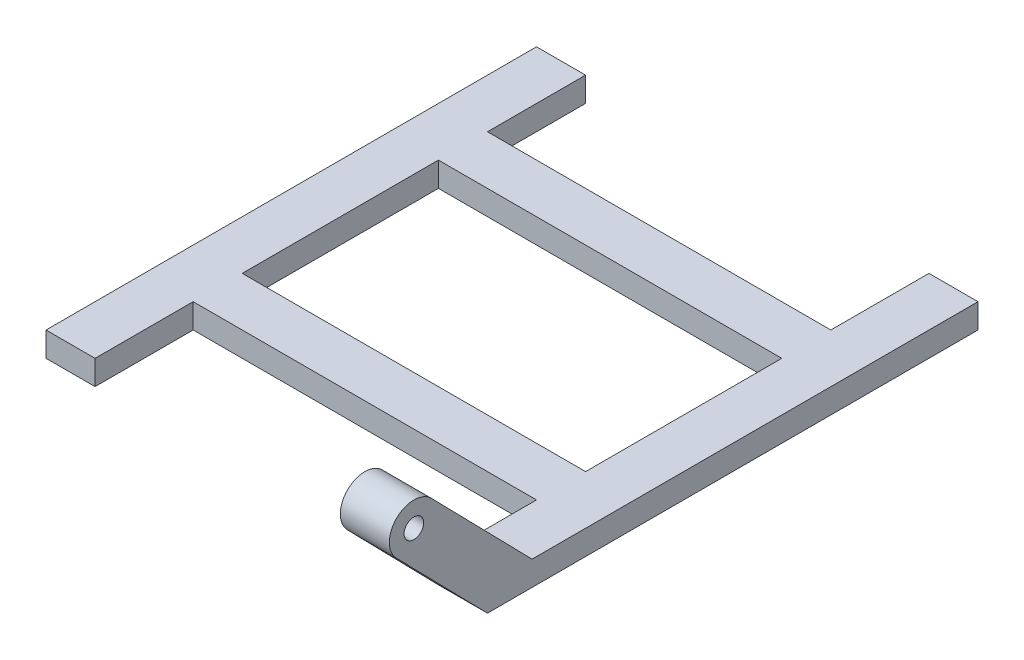
ISO-10303-21;
HEADER;
FILE_DESCRIPTION(('STEP AP214'),'2;1');
FILE_NAME('part.step','',(''),(''),'','','');
FILE_SCHEMA(('AUTOMOTIVE_DESIGN { 1 0 10303 214 1 1 1 1 }'));
ENDSEC;
DATA;
#1=APPLICATION_CONTEXT('core data for automotive mechanical design processes');
#2=APPLICATION_PROTOCOL_DEFINITION('international standard','automotive_design',2000,#1);
#3=PRODUCT_CONTEXT('',#1,'mechanical');
#4=PRODUCT('Part','Part','',(#3));
#5=PRODUCT_RELATED_PRODUCT_CATEGORY('part','',(#4));
#6=PRODUCT_DEFINITION_FORMATION('','',#4);
#7=PRODUCT_DEFINITION_CONTEXT('part definition',#1,'design');
#8=PRODUCT_DEFINITION('design','',#6,#7);
#9=PRODUCT_DEFINITION_SHAPE('','',#8);
#10=(LENGTH_UNIT() NAMED_UNIT(*) SI_UNIT(.MILLI.,.METRE.));
#11=(NAMED_UNIT(*) PLANE_ANGLE_UNIT() SI_UNIT($,.RADIAN.));
#12=(NAMED_UNIT(*) SI_UNIT($,.STERADIAN.) SOLID_ANGLE_UNIT());
#13=UNCERTAINTY_MEASURE_WITH_UNIT(LENGTH_MEASURE(1.E-05),#10,'distance_accuracy_value','');
#14=(GEOMETRIC_REPRESENTATION_CONTEXT(3) GLOBAL_UNCERTAINTY_ASSIGNED_CONTEXT((#13)) GLOBAL_UNIT_ASSIGNED_CONTEXT((#10,
#11,#12)) REPRESENTATION_CONTEXT('',''));
#15=CARTESIAN_POINT('',(0.,0.,0.));
#16=DIRECTION('',(0.,0.,1.));
#17=DIRECTION('',(1.,0.,0.));
#18=AXIS2_PLACEMENT_3D('',#15,#16,#17);
#19=CARTESIAN_POINT('',(0.,5.,-25.));
#20=DIRECTION('',(0.,0.,-1.));
#21=DIRECTION('',(-1.,0.,0.));
#22=AXIS2_PLACEMENT_3D('',#19,#20,#21);
#23=PLANE('',#22);
#24=DIRECTION('',(1.,0.,0.));
#25=VECTOR('',#24,1.);
#26=CARTESIAN_POINT('',(0.,0.,-25.));
#27=LINE('',#26,#25);
#28=CARTESIAN_POINT('',(-45.,0.,-25.));
#29=VERTEX_POINT('',#28);
#30=CARTESIAN_POINT('',(-35.,0.,-25.));
#31=VERTEX_POINT('',#30);
#32=EDGE_CURVE('E286',#29,#31,#27,.T.);
#33=ORIENTED_EDGE('',*,*,#32,.F.);
#34=DIRECTION('',(0.,-1.,0.));
#35=VECTOR('',#34,1.);
#36=CARTESIAN_POINT('',(-45.,5.,-25.));
#37=LINE('',#36,#35);
#38=CARTESIAN_POINT('',(-45.,5.,-25.));
#39=VERTEX_POINT('',#38);
#40=EDGE_CURVE('E332',#39,#29,#37,.T.);
#41=ORIENTED_EDGE('',*,*,#40,.F.);
#42=DIRECTION('',(1.,0.,0.));
#43=VECTOR('',#42,1.);
#44=CARTESIAN_POINT('',(0.,5.,-25.));
#45=LINE('',#44,#43);
#46=CARTESIAN_POINT('',(-35.,5.,-25.));
#47=VERTEX_POINT('',#46);
#48=EDGE_CURVE('E258',#39,#47,#45,.T.);
#49=ORIENTED_EDGE('',*,*,#48,.T.);
#50=DIRECTION('',(0.,-1.,0.));
#51=VECTOR('',#50,1.);
#52=CARTESIAN_POINT('',(-35.,5.,-25.));
#53=LINE('',#52,#51);
#54=EDGE_CURVE('E334',#47,#31,#53,.T.);
#55=ORIENTED_EDGE('',*,*,#54,.T.);
#56=EDGE_LOOP('',(#33,#41,#49,#55));
#57=FACE_BOUND('',#56,.T.);
#58=ADVANCED_FACE('F89',(#57),#23,.T.);
#59=CARTESIAN_POINT('',(-45.,5.,0.));
#60=DIRECTION('',(1.,0.,0.));
#61=DIRECTION('',(0.,0.,-1.));
#62=AXIS2_PLACEMENT_3D('',#59,#60,#61);
#63=PLANE('',#62);
#64=DIRECTION('',(0.,0.,1.));
#65=VECTOR('',#64,1.);
#66=CARTESIAN_POINT('',(-45.,0.,0.));
#67=LINE('',#66,#65);
#68=CARTESIAN_POINT('',(-45.,0.,75.));
#69=VERTEX_POINT('',#68);
#70=EDGE_CURVE('E292',#29,#69,#67,.T.);
#71=ORIENTED_EDGE('',*,*,#70,.T.);
#72=DIRECTION('',(0.,-1.,0.));
#73=VECTOR('',#72,1.);
#74=CARTESIAN_POINT('',(-45.,5.,75.));
#75=LINE('',#74,#73);
#76=CARTESIAN_POINT('',(-45.,5.,75.));
#77=VERTEX_POINT('',#76);
#78=EDGE_CURVE('E329',#77,#69,#75,.T.);
#79=ORIENTED_EDGE('',*,*,#78,.F.);
#80=DIRECTION('',(0.,0.,1.));
#81=VECTOR('',#80,1.);
#82=CARTESIAN_POINT('',(-45.,5.,0.));
#83=LINE('',#82,#81);
#84=EDGE_CURVE('E264',#39,#77,#83,.T.);
#85=ORIENTED_EDGE('',*,*,#84,.F.);
#86=ORIENTED_EDGE('',*,*,#40,.T.);
#87=EDGE_LOOP('',(#71,#79,#85,#86));
#88=FACE_BOUND('',#87,.T.);
#89=ADVANCED_FACE('F427',(#88),#63,.F.);
#90=CARTESIAN_POINT('',(0.,5.,75.));
#91=DIRECTION('',(0.,0.,-1.));
#92=DIRECTION('',(-1.,0.,0.));
#93=AXIS2_PLACEMENT_3D('',#90,#91,#92);
#94=PLANE('',#93);
#95=DIRECTION('',(1.,0.,0.));
#96=VECTOR('',#95,1.);
#97=CARTESIAN_POINT('',(0.,0.,75.));
#98=LINE('',#97,#96);
#99=CARTESIAN_POINT('',(-35.,0.,75.));
#100=VERTEX_POINT('',#99);
#101=EDGE_CURVE('E294',#69,#100,#98,.T.);
#102=ORIENTED_EDGE('',*,*,#101,.T.);
#103=DIRECTION('',(0.,-1.,0.));
#104=VECTOR('',#103,1.);
#105=CARTESIAN_POINT('',(-35.,5.,75.));
#106=LINE('',#105,#104);
#107=CARTESIAN_POINT('',(-35.,5.,75.));
#108=VERTEX_POINT('',#107);
#109=EDGE_CURVE('E326',#108,#100,#106,.T.);
#110=ORIENTED_EDGE('',*,*,#109,.F.);
#111=DIRECTION('',(1.,0.,0.));
#112=VECTOR('',#111,1.);
#113=CARTESIAN_POINT('',(0.,5.,75.));
#114=LINE('',#113,#112);
#115=EDGE_CURVE('E266',#77,#108,#114,.T.);
#116=ORIENTED_EDGE('',*,*,#115,.F.);
#117=ORIENTED_EDGE('',*,*,#78,.T.);
#118=EDGE_LOOP('',(#102,#110,#116,#117));
#119=FACE_BOUND('',#118,.T.);
#120=ADVANCED_FACE('F423',(#119),#94,.F.);
#121=CARTESIAN_POINT('',(-35.,5.,0.));
#122=DIRECTION('',(1.,0.,0.));
#123=DIRECTION('',(0.,0.,-1.));
#124=AXIS2_PLACEMENT_3D('',#121,#122,#123);
#125=PLANE('',#124);
#126=DIRECTION('',(0.,0.,1.));
#127=VECTOR('',#126,1.);
#128=CARTESIAN_POINT('',(-35.,0.,0.));
#129=LINE('',#128,#127);
#130=CARTESIAN_POINT('',(-35.,0.,55.));
#131=VERTEX_POINT('',#130);
#132=EDGE_CURVE('E288',#131,#100,#129,.T.);
#133=ORIENTED_EDGE('',*,*,#132,.F.);
#134=DIRECTION('',(0.,1.,0.));
#135=VECTOR('',#134,1.);
#136=CARTESIAN_POINT('',(-35.,5.,55.));
#137=LINE('',#136,#135);
#138=CARTESIAN_POINT('',(-35.,5.,55.));
#139=VERTEX_POINT('',#138);
#140=EDGE_CURVE('E98',#131,#139,#137,.T.);
#141=ORIENTED_EDGE('',*,*,#140,.T.);
#142=DIRECTION('',(0.,0.,1.));
#143=VECTOR('',#142,1.);
#144=CARTESIAN_POINT('',(-35.,5.,0.));
#145=LINE('',#144,#143);
#146=EDGE_CURVE('E260',#139,#108,#145,.T.);
#147=ORIENTED_EDGE('',*,*,#146,.T.);
#148=ORIENTED_EDGE('',*,*,#109,.T.);
#149=EDGE_LOOP('',(#133,#141,#147,#148));
#150=FACE_BOUND('',#149,.T.);
#151=ADVANCED_FACE('F419',(#150),#125,.T.);
#152=DIRECTION('',(0.,1.,0.));
#153=VECTOR('',#152,1.);
#154=CARTESIAN_POINT('',(-35.,5.,45.));
#155=LINE('',#154,#153);
#156=CARTESIAN_POINT('',(-35.,0.,45.));
#157=VERTEX_POINT('',#156);
#158=CARTESIAN_POINT('',(-35.,5.,45.));
#159=VERTEX_POINT('',#158);
#160=EDGE_CURVE('E12',#157,#159,#155,.T.);
#161=ORIENTED_EDGE('',*,*,#160,.F.);
#162=CARTESIAN_POINT('',(-35.,0.,5.));
#163=VERTEX_POINT('',#162);
#164=EDGE_CURVE('E289',#163,#157,#129,.T.);
#165=ORIENTED_EDGE('',*,*,#164,.F.);
#166=DIRECTION('',(0.,-1.,0.));
#167=VECTOR('',#166,1.);
#168=CARTESIAN_POINT('',(-35.,5.,5.));
#169=LINE('',#168,#167);
#170=CARTESIAN_POINT('',(-35.,5.,5.));
#171=VERTEX_POINT('',#170);
#172=EDGE_CURVE('E324',#171,#163,#169,.T.);
#173=ORIENTED_EDGE('',*,*,#172,.F.);
#174=EDGE_CURVE('E261',#171,#159,#145,.T.);
#175=ORIENTED_EDGE('',*,*,#174,.T.);
#176=EDGE_LOOP('',(#161,#165,#173,#175));
#177=FACE_BOUND('',#176,.T.);
#178=ADVANCED_FACE('F434',(#177),#125,.T.);
#179=CARTESIAN_POINT('',(0.,5.,5.));
#180=DIRECTION('',(0.,0.,-1.));
#181=DIRECTION('',(-1.,0.,0.));
#182=AXIS2_PLACEMENT_3D('',#179,#180,#181);
#183=PLANE('',#182);
#184=DIRECTION('',(1.,0.,0.));
#185=VECTOR('',#184,1.);
#186=CARTESIAN_POINT('',(0.,0.,5.));
#187=LINE('',#186,#185);
#188=CARTESIAN_POINT('',(35.,0.,5.));
#189=VERTEX_POINT('',#188);
#190=EDGE_CURVE('E297',#163,#189,#187,.T.);
#191=ORIENTED_EDGE('',*,*,#190,.T.);
#192=DIRECTION('',(0.,-1.,0.));
#193=VECTOR('',#192,1.);
#194=CARTESIAN_POINT('',(35.,5.,5.));
#195=LINE('',#194,#193);
#196=CARTESIAN_POINT('',(35.,5.,5.));
#197=VERTEX_POINT('',#196);
#198=EDGE_CURVE('E321',#197,#189,#195,.T.);
#199=ORIENTED_EDGE('',*,*,#198,.F.);
#200=DIRECTION('',(1.,0.,0.));
#201=VECTOR('',#200,1.);
#202=CARTESIAN_POINT('',(0.,5.,5.));
#203=LINE('',#202,#201);
#204=EDGE_CURVE('E269',#171,#197,#203,.T.);
#205=ORIENTED_EDGE('',*,*,#204,.F.);
#206=ORIENTED_EDGE('',*,*,#172,.T.);
#207=EDGE_LOOP('',(#191,#199,#205,#206));
#208=FACE_BOUND('',#207,.T.);
#209=ADVANCED_FACE('F442',(#208),#183,.F.);
#210=CARTESIAN_POINT('',(35.,5.,0.));
#211=DIRECTION('',(1.,0.,0.));
#212=DIRECTION('',(0.,0.,-1.));
#213=AXIS2_PLACEMENT_3D('',#210,#211,#212);
#214=PLANE('',#213);
#215=DIRECTION('',(0.,0.,1.));
#216=VECTOR('',#215,1.);
#217=CARTESIAN_POINT('',(35.,0.,0.));
#218=LINE('',#217,#216);
#219=CARTESIAN_POINT('',(35.,0.,45.));
#220=VERTEX_POINT('',#219);
#221=EDGE_CURVE('E300',#189,#220,#218,.T.);
#222=ORIENTED_EDGE('',*,*,#221,.T.);
#223=DIRECTION('',(0.,1.,0.));
#224=VECTOR('',#223,1.);
#225=CARTESIAN_POINT('',(35.,5.,45.));
#226=LINE('',#225,#224);
#227=CARTESIAN_POINT('',(35.,5.,45.));
#228=VERTEX_POINT('',#227);
#229=EDGE_CURVE('E338',#220,#228,#226,.T.);
#230=ORIENTED_EDGE('',*,*,#229,.T.);
#231=DIRECTION('',(0.,0.,1.));
#232=VECTOR('',#231,1.);
#233=CARTESIAN_POINT('',(35.,5.,0.));
#234=LINE('',#233,#232);
#235=EDGE_CURVE('E271',#197,#228,#234,.T.);
#236=ORIENTED_EDGE('',*,*,#235,.F.);
#237=ORIENTED_EDGE('',*,*,#198,.T.);
#238=EDGE_LOOP('',(#222,#230,#236,#237));
#239=FACE_BOUND('',#238,.T.);
#240=ADVANCED_FACE('F387',(#239),#214,.F.);
#241=CARTESIAN_POINT('',(35.,0.,55.));
#242=VERTEX_POINT('',#241);
#243=CARTESIAN_POINT('',(35.,0.,75.));
#244=VERTEX_POINT('',#243);
#245=EDGE_CURVE('E299',#242,#244,#218,.T.);
#246=ORIENTED_EDGE('',*,*,#245,.T.);
#247=DIRECTION('',(0.,-0.715139421492409,-0.698981836550495));
#248=VECTOR('',#247,1.);
#249=CARTESIAN_POINT('',(35.,-37.4902099668317,38.3568294129373));
#250=LINE('',#249,#248);
#251=CARTESIAN_POINT('',(35.,19.0050908172475,93.5756971074621));
#252=VERTEX_POINT('',#251);
#253=EDGE_CURVE('E248',#252,#244,#250,.T.);
#254=ORIENTED_EDGE('',*,*,#253,.F.);
#255=CARTESIAN_POINT('',(35.,22.5,90.));
#256=DIRECTION('',(1.,0.,0.));
#257=DIRECTION('',(0.,0.,-1.));
#258=AXIS2_PLACEMENT_3D('',#255,#256,#257);
#259=CIRCLE('',#258,5.);
#260=CARTESIAN_POINT('',(35.,25.9949091827525,86.424302892538));
#261=VERTEX_POINT('',#260);
#262=EDGE_CURVE('E254',#252,#261,#259,.F.);
#263=ORIENTED_EDGE('',*,*,#262,.T.);
#264=DIRECTION('',(0.,-0.715139421492409,-0.698981836550495));
#265=VECTOR('',#264,1.);
#266=CARTESIAN_POINT('',(35.,-30.5003916013267,31.2054351980132));
#267=LINE('',#266,#265);
#268=CARTESIAN_POINT('',(35.,5.,65.9037446101458));
#269=VERTEX_POINT('',#268);
#270=EDGE_CURVE('E222',#261,#269,#267,.T.);
#271=ORIENTED_EDGE('',*,*,#270,.T.);
#272=CARTESIAN_POINT('',(35.,5.,55.));
#273=VERTEX_POINT('',#272);
#274=EDGE_CURVE('E111',#273,#269,#234,.T.);
#275=ORIENTED_EDGE('',*,*,#274,.F.);
#276=DIRECTION('',(0.,1.,0.));
#277=VECTOR('',#276,1.);
#278=CARTESIAN_POINT('',(35.,5.,55.));
#279=LINE('',#278,#277);
#280=EDGE_CURVE('E336',#242,#273,#279,.T.);
#281=ORIENTED_EDGE('',*,*,#280,.F.);
#282=EDGE_LOOP('',(#246,#254,#263,#271,#275,#281));
#283=FACE_BOUND('',#282,.T.);
#284=CARTESIAN_POINT('',(35.,22.5,90.));
#285=DIRECTION('',(1.,0.,0.));
#286=DIRECTION('',(0.,0.,-1.));
#287=AXIS2_PLACEMENT_3D('',#284,#285,#286);
#288=CIRCLE('',#287,2.);
#289=CARTESIAN_POINT('',(35.,22.5,88.));
#290=VERTEX_POINT('',#289);
#291=EDGE_CURVE('E250',#290,#290,#288,.F.);
#292=ORIENTED_EDGE('',*,*,#291,.F.);
#293=EDGE_LOOP('',(#292));
#294=FACE_BOUND('',#293,.T.);
#295=ADVANCED_FACE('F384',(#283,#294),#214,.F.);
#296=CARTESIAN_POINT('',(45.,5.,0.));
#297=DIRECTION('',(1.,0.,0.));
#298=DIRECTION('',(0.,0.,-1.));
#299=AXIS2_PLACEMENT_3D('',#296,#297,#298);
#300=PLANE('',#299);
#301=DIRECTION('',(0.,0.715139421492409,0.698981836550495));
#302=VECTOR('',#301,1.);
#303=CARTESIAN_POINT('',(45.,-37.4902099668317,38.3568294129373));
#304=LINE('',#303,#302);
#305=CARTESIAN_POINT('',(45.,0.,75.));
#306=VERTEX_POINT('',#305);
#307=CARTESIAN_POINT('',(45.,19.0050908172475,93.575697107462));
#308=VERTEX_POINT('',#307);
#309=EDGE_CURVE('E235',#306,#308,#304,.T.);
#310=ORIENTED_EDGE('',*,*,#309,.F.);
#311=DIRECTION('',(0.,0.,1.));
#312=VECTOR('',#311,1.);
#313=CARTESIAN_POINT('',(45.,0.,0.));
#314=LINE('',#313,#312);
#315=CARTESIAN_POINT('',(45.,0.,-25.));
#316=VERTEX_POINT('',#315);
#317=EDGE_CURVE('E307',#316,#306,#314,.T.);
#318=ORIENTED_EDGE('',*,*,#317,.F.);
#319=DIRECTION('',(0.,-1.,0.));
#320=VECTOR('',#319,1.);
#321=CARTESIAN_POINT('',(45.,5.,-25.));
#322=LINE('',#321,#320);
#323=CARTESIAN_POINT('',(45.,5.,-25.));
#324=VERTEX_POINT('',#323);
#325=EDGE_CURVE('E319',#324,#316,#322,.T.);
#326=ORIENTED_EDGE('',*,*,#325,.F.);
#327=DIRECTION('',(0.,0.,1.));
#328=VECTOR('',#327,1.);
#329=CARTESIAN_POINT('',(45.,5.,0.));
#330=LINE('',#329,#328);
#331=CARTESIAN_POINT('',(45.,5.,65.9037446101458));
#332=VERTEX_POINT('',#331);
#333=EDGE_CURVE('E239',#324,#332,#330,.T.);
#334=ORIENTED_EDGE('',*,*,#333,.T.);
#335=DIRECTION('',(0.,0.715139421492409,0.698981836550495));
#336=VECTOR('',#335,1.);
#337=CARTESIAN_POINT('',(45.,-30.5003916013267,31.2054351980132));
#338=LINE('',#337,#336);
#339=CARTESIAN_POINT('',(45.,25.9949091827525,86.424302892538));
#340=VERTEX_POINT('',#339);
#341=EDGE_CURVE('E221',#332,#340,#338,.T.);
#342=ORIENTED_EDGE('',*,*,#341,.T.);
#343=CARTESIAN_POINT('',(45.,22.5,90.));
#344=DIRECTION('',(1.,0.,0.));
#345=DIRECTION('',(0.,0.,-1.));
#346=AXIS2_PLACEMENT_3D('',#343,#344,#345);
#347=CIRCLE('',#346,5.);
#348=EDGE_CURVE('E229',#340,#308,#347,.T.);
#349=ORIENTED_EDGE('',*,*,#348,.T.);
#350=EDGE_LOOP('',(#310,#318,#326,#334,#342,#349));
#351=FACE_BOUND('',#350,.T.);
#352=CARTESIAN_POINT('',(45.,22.5,90.));
#353=DIRECTION('',(1.,0.,0.));
#354=DIRECTION('',(0.,0.,-1.));
#355=AXIS2_PLACEMENT_3D('',#352,#353,#354);
#356=CIRCLE('',#355,2.);
#357=CARTESIAN_POINT('',(45.,22.5,88.));
#358=VERTEX_POINT('',#357);
#359=EDGE_CURVE('E226',#358,#358,#356,.T.);
#360=ORIENTED_EDGE('',*,*,#359,.F.);
#361=EDGE_LOOP('',(#360));
#362=FACE_BOUND('',#361,.T.);
#363=ADVANCED_FACE('F237',(#351,#362),#300,.T.);
#364=CARTESIAN_POINT('',(0.,5.,-25.));
#365=DIRECTION('',(0.,0.,-1.));
#366=DIRECTION('',(-1.,0.,0.));
#367=AXIS2_PLACEMENT_3D('',#364,#365,#366);
#368=PLANE('',#367);
#369=DIRECTION('',(1.,0.,0.));
#370=VECTOR('',#369,1.);
#371=CARTESIAN_POINT('',(0.,0.,-25.));
#372=LINE('',#371,#370);
#373=CARTESIAN_POINT('',(35.,0.,-25.));
#374=VERTEX_POINT('',#373);
#375=EDGE_CURVE('E309',#374,#316,#372,.T.);
#376=ORIENTED_EDGE('',*,*,#375,.F.);
#377=DIRECTION('',(0.,-1.,0.));
#378=VECTOR('',#377,1.);
#379=CARTESIAN_POINT('',(35.,5.,-25.));
#380=LINE('',#379,#378);
#381=CARTESIAN_POINT('',(35.,5.,-25.));
#382=VERTEX_POINT('',#381);
#383=EDGE_CURVE('E317',#382,#374,#380,.T.);
#384=ORIENTED_EDGE('',*,*,#383,.F.);
#385=DIRECTION('',(1.,0.,0.));
#386=VECTOR('',#385,1.);
#387=CARTESIAN_POINT('',(0.,5.,-25.));
#388=LINE('',#387,#386);
#389=EDGE_CURVE('E276',#382,#324,#388,.T.);
#390=ORIENTED_EDGE('',*,*,#389,.T.);
#391=ORIENTED_EDGE('',*,*,#325,.T.);
#392=EDGE_LOOP('',(#376,#384,#390,#391));
#393=FACE_BOUND('',#392,.T.);
#394=ADVANCED_FACE('F379',(#393),#368,.T.);
#395=CARTESIAN_POINT('',(35.,0.,-5.));
#396=VERTEX_POINT('',#395);
#397=EDGE_CURVE('E304',#374,#396,#218,.T.);
#398=ORIENTED_EDGE('',*,*,#397,.T.);
#399=DIRECTION('',(0.,-1.,0.));
#400=VECTOR('',#399,1.);
#401=CARTESIAN_POINT('',(35.,5.,-5.));
#402=LINE('',#401,#400);
#403=CARTESIAN_POINT('',(35.,5.,-5.));
#404=VERTEX_POINT('',#403);
#405=EDGE_CURVE('E315',#404,#396,#402,.T.);
#406=ORIENTED_EDGE('',*,*,#405,.F.);
#407=EDGE_CURVE('E274',#382,#404,#234,.T.);
#408=ORIENTED_EDGE('',*,*,#407,.F.);
#409=ORIENTED_EDGE('',*,*,#383,.T.);
#410=EDGE_LOOP('',(#398,#406,#408,#409));
#411=FACE_BOUND('',#410,.T.);
#412=ADVANCED_FACE('F365',(#411),#214,.F.);
#413=CARTESIAN_POINT('',(0.,5.,-5.));
#414=DIRECTION('',(0.,0.,-1.));
#415=DIRECTION('',(-1.,0.,0.));
#416=AXIS2_PLACEMENT_3D('',#413,#414,#415);
#417=PLANE('',#416);
#418=DIRECTION('',(1.,0.,0.));
#419=VECTOR('',#418,1.);
#420=CARTESIAN_POINT('',(0.,0.,-5.));
#421=LINE('',#420,#419);
#422=CARTESIAN_POINT('',(-35.,0.,-5.));
#423=VERTEX_POINT('',#422);
#424=EDGE_CURVE('E259',#423,#396,#421,.T.);
#425=ORIENTED_EDGE('',*,*,#424,.F.);
#426=DIRECTION('',(0.,-1.,0.));
#427=VECTOR('',#426,1.);
#428=CARTESIAN_POINT('',(-35.,5.,-5.));
#429=LINE('',#428,#427);
#430=CARTESIAN_POINT('',(-35.,5.,-5.));
#431=VERTEX_POINT('',#430);
#432=EDGE_CURVE('E282',#431,#423,#429,.T.);
#433=ORIENTED_EDGE('',*,*,#432,.F.);
#434=DIRECTION('',(1.,0.,0.));
#435=VECTOR('',#434,1.);
#436=CARTESIAN_POINT('',(0.,5.,-5.));
#437=LINE('',#436,#435);
#438=EDGE_CURVE('E279',#431,#404,#437,.T.);
#439=ORIENTED_EDGE('',*,*,#438,.T.);
#440=ORIENTED_EDGE('',*,*,#405,.T.);
#441=EDGE_LOOP('',(#425,#433,#439,#440));
#442=FACE_BOUND('',#441,.T.);
#443=ADVANCED_FACE('F371',(#442),#417,.T.);
#444=EDGE_CURVE('E283',#31,#423,#129,.T.);
#445=ORIENTED_EDGE('',*,*,#444,.F.);
#446=ORIENTED_EDGE('',*,*,#54,.F.);
#447=EDGE_CURVE('E255',#47,#431,#145,.T.);
#448=ORIENTED_EDGE('',*,*,#447,.T.);
#449=ORIENTED_EDGE('',*,*,#432,.T.);
#450=EDGE_LOOP('',(#445,#446,#448,#449));
#451=FACE_BOUND('',#450,.T.);
#452=ADVANCED_FACE('F431',(#451),#125,.T.);
#453=CARTESIAN_POINT('',(0.,0.,0.));
#454=DIRECTION('',(0.,1.,0.));
#455=DIRECTION('',(0.,0.,1.));
#456=AXIS2_PLACEMENT_3D('',#453,#454,#455);
#457=PLANE('',#456);
#458=DIRECTION('',(1.,0.,0.));
#459=VECTOR('',#458,1.);
#460=CARTESIAN_POINT('',(-35.,0.,55.));
#461=LINE('',#460,#459);
#462=EDGE_CURVE('E93',#131,#242,#461,.T.);
#463=ORIENTED_EDGE('',*,*,#462,.F.);
#464=ORIENTED_EDGE('',*,*,#132,.T.);
#465=ORIENTED_EDGE('',*,*,#101,.F.);
#466=ORIENTED_EDGE('',*,*,#70,.F.);
#467=ORIENTED_EDGE('',*,*,#32,.T.);
#468=ORIENTED_EDGE('',*,*,#444,.T.);
#469=ORIENTED_EDGE('',*,*,#424,.T.);
#470=ORIENTED_EDGE('',*,*,#397,.F.);
#471=ORIENTED_EDGE('',*,*,#375,.T.);
#472=ORIENTED_EDGE('',*,*,#317,.T.);
#473=DIRECTION('',(1.,0.,0.));
#474=VECTOR('',#473,1.);
#475=CARTESIAN_POINT('',(0.,0.,75.));
#476=LINE('',#475,#474);
#477=EDGE_CURVE('E303',#244,#306,#476,.T.);
#478=ORIENTED_EDGE('',*,*,#477,.F.);
#479=ORIENTED_EDGE('',*,*,#245,.F.);
#480=EDGE_LOOP('',(#463,#464,#465,#466,#467,#468,#469,#470,#471,#472,#478,#479));
#481=FACE_BOUND('',#480,.T.);
#482=ORIENTED_EDGE('',*,*,#164,.T.);
#483=DIRECTION('',(1.,0.,0.));
#484=VECTOR('',#483,1.);
#485=CARTESIAN_POINT('',(-35.,0.,45.));
#486=LINE('',#485,#484);
#487=EDGE_CURVE('E253',#157,#220,#486,.T.);
#488=ORIENTED_EDGE('',*,*,#487,.T.);
#489=ORIENTED_EDGE('',*,*,#221,.F.);
#490=ORIENTED_EDGE('',*,*,#190,.F.);
#491=EDGE_LOOP('',(#482,#488,#489,#490));
#492=FACE_BOUND('',#491,.T.);
#493=ADVANCED_FACE('F358',(#481,#492),#457,.F.);
#494=CARTESIAN_POINT('',(0.,5.,0.));
#495=DIRECTION('',(0.,1.,0.));
#496=DIRECTION('',(0.,0.,1.));
#497=AXIS2_PLACEMENT_3D('',#494,#495,#496);
#498=PLANE('',#497);
#499=DIRECTION('',(1.,0.,0.));
#500=VECTOR('',#499,1.);
#501=CARTESIAN_POINT('',(-5.03551020920824,5.,65.9037446101458));
#502=LINE('',#501,#500);
#503=EDGE_CURVE('E106',#269,#332,#502,.T.);
#504=ORIENTED_EDGE('',*,*,#503,.T.);
#505=ORIENTED_EDGE('',*,*,#333,.F.);
#506=ORIENTED_EDGE('',*,*,#389,.F.);
#507=ORIENTED_EDGE('',*,*,#407,.T.);
#508=ORIENTED_EDGE('',*,*,#438,.F.);
#509=ORIENTED_EDGE('',*,*,#447,.F.);
#510=ORIENTED_EDGE('',*,*,#48,.F.);
#511=ORIENTED_EDGE('',*,*,#84,.T.);
#512=ORIENTED_EDGE('',*,*,#115,.T.);
#513=ORIENTED_EDGE('',*,*,#146,.F.);
#514=DIRECTION('',(1.,0.,0.));
#515=VECTOR('',#514,1.);
#516=CARTESIAN_POINT('',(-35.,5.,55.));
#517=LINE('',#516,#515);
#518=EDGE_CURVE('E287',#139,#273,#517,.T.);
#519=ORIENTED_EDGE('',*,*,#518,.T.);
#520=ORIENTED_EDGE('',*,*,#274,.T.);
#521=EDGE_LOOP('',(#504,#505,#506,#507,#508,#509,#510,#511,#512,#513,#519,#520));
#522=FACE_BOUND('',#521,.T.);
#523=DIRECTION('',(1.,0.,0.));
#524=VECTOR('',#523,1.);
#525=CARTESIAN_POINT('',(-35.,5.,45.));
#526=LINE('',#525,#524);
#527=EDGE_CURVE('E341',#159,#228,#526,.T.);
#528=ORIENTED_EDGE('',*,*,#527,.F.);
#529=ORIENTED_EDGE('',*,*,#174,.F.);
#530=ORIENTED_EDGE('',*,*,#204,.T.);
#531=ORIENTED_EDGE('',*,*,#235,.T.);
#532=EDGE_LOOP('',(#528,#529,#530,#531));
#533=FACE_BOUND('',#532,.T.);
#534=ADVANCED_FACE('F374',(#522,#533),#498,.T.);
#535=CARTESIAN_POINT('',(-35.,5.,55.));
#536=DIRECTION('',(0.,0.,-1.));
#537=DIRECTION('',(-1.,0.,0.));
#538=AXIS2_PLACEMENT_3D('',#535,#536,#537);
#539=PLANE('',#538);
#540=ORIENTED_EDGE('',*,*,#462,.T.);
#541=ORIENTED_EDGE('',*,*,#280,.T.);
#542=ORIENTED_EDGE('',*,*,#518,.F.);
#543=ORIENTED_EDGE('',*,*,#140,.F.);
#544=EDGE_LOOP('',(#540,#541,#542,#543));
#545=FACE_BOUND('',#544,.T.);
#546=ADVANCED_FACE('F353',(#545),#539,.F.);
#547=CARTESIAN_POINT('',(-35.,5.,45.));
#548=DIRECTION('',(0.,0.,-1.));
#549=DIRECTION('',(-1.,0.,0.));
#550=AXIS2_PLACEMENT_3D('',#547,#548,#549);
#551=PLANE('',#550);
#552=ORIENTED_EDGE('',*,*,#487,.F.);
#553=ORIENTED_EDGE('',*,*,#160,.T.);
#554=ORIENTED_EDGE('',*,*,#527,.T.);
#555=ORIENTED_EDGE('',*,*,#229,.F.);
#556=EDGE_LOOP('',(#552,#553,#554,#555));
#557=FACE_BOUND('',#556,.T.);
#558=ADVANCED_FACE('F91',(#557),#551,.T.);
#559=CARTESIAN_POINT('',(-5.03551020920824,22.5,90.));
#560=DIRECTION('',(1.,0.,0.));
#561=DIRECTION('',(0.,0.,-1.));
#562=AXIS2_PLACEMENT_3D('',#559,#560,#561);
#563=CYLINDRICAL_SURFACE('',#562,5.);
#564=ORIENTED_EDGE('',*,*,#262,.F.);
#565=DIRECTION('',(1.,0.,0.));
#566=VECTOR('',#565,1.);
#567=CARTESIAN_POINT('',(-5.03551020920824,19.0050908172475,93.5756971074621));
#568=LINE('',#567,#566);
#569=EDGE_CURVE('E225',#252,#308,#568,.T.);
#570=ORIENTED_EDGE('',*,*,#569,.T.);
#571=ORIENTED_EDGE('',*,*,#348,.F.);
#572=DIRECTION('',(1.,0.,0.));
#573=VECTOR('',#572,1.);
#574=CARTESIAN_POINT('',(-5.03551020920824,25.9949091827525,86.424302892538));
#575=LINE('',#574,#573);
#576=EDGE_CURVE('E217',#261,#340,#575,.T.);
#577=ORIENTED_EDGE('',*,*,#576,.F.);
#578=EDGE_LOOP('',(#564,#570,#571,#577));
#579=FACE_BOUND('',#578,.T.);
#580=ADVANCED_FACE('F230',(#579),#563,.T.);
#581=CARTESIAN_POINT('',(-5.03551020920825,-37.4902099668317,38.3568294129373));
#582=DIRECTION('',(0.,0.698981836550495,-0.715139421492409));
#583=DIRECTION('',(0.,0.715139421492409,0.698981836550495));
#584=AXIS2_PLACEMENT_3D('',#581,#582,#583);
#585=PLANE('',#584);
#586=ORIENTED_EDGE('',*,*,#569,.F.);
#587=ORIENTED_EDGE('',*,*,#253,.T.);
#588=ORIENTED_EDGE('',*,*,#477,.T.);
#589=ORIENTED_EDGE('',*,*,#309,.T.);
#590=EDGE_LOOP('',(#586,#587,#588,#589));
#591=FACE_BOUND('',#590,.T.);
#592=ADVANCED_FACE('F382',(#591),#585,.F.);
#593=CARTESIAN_POINT('',(-5.03551020920825,-30.5003916013267,31.2054351980132));
#594=DIRECTION('',(0.,0.698981836550495,-0.715139421492409));
#595=DIRECTION('',(0.,0.715139421492409,0.698981836550495));
#596=AXIS2_PLACEMENT_3D('',#593,#594,#595);
#597=PLANE('',#596);
#598=ORIENTED_EDGE('',*,*,#270,.F.);
#599=ORIENTED_EDGE('',*,*,#576,.T.);
#600=ORIENTED_EDGE('',*,*,#341,.F.);
#601=ORIENTED_EDGE('',*,*,#503,.F.);
#602=EDGE_LOOP('',(#598,#599,#600,#601));
#603=FACE_BOUND('',#602,.T.);
#604=ADVANCED_FACE('F219',(#603),#597,.T.);
#605=CARTESIAN_POINT('',(-5.03551020920824,22.5,90.));
#606=DIRECTION('',(1.,0.,0.));
#607=DIRECTION('',(0.,0.,-1.));
#608=AXIS2_PLACEMENT_3D('',#605,#606,#607);
#609=CYLINDRICAL_SURFACE('',#608,2.);
#610=ORIENTED_EDGE('',*,*,#291,.T.);
#611=EDGE_LOOP('',(#610));
#612=FACE_BOUND('',#611,.T.);
#613=ORIENTED_EDGE('',*,*,#359,.T.);
#614=EDGE_LOOP('',(#613));
#615=FACE_BOUND('',#614,.T.);
#616=ADVANCED_FACE('F391',(#612,#615),#609,.F.);
#617=CLOSED_SHELL('',(#58,#89,#120,#151,#178,#209,#240,#295,#363,#394,#412,#443,#452,#493,#534,
#546,#558,#580,#592,#604,#616));
#618=MANIFOLD_SOLID_BREP('B2',#617);
#619=ADVANCED_BREP_SHAPE_REPRESENTATION('',(#18,#618),#14);
#620=SHAPE_DEFINITION_REPRESENTATION(#9,#619);
ENDSEC;
END-ISO-10303-21;
